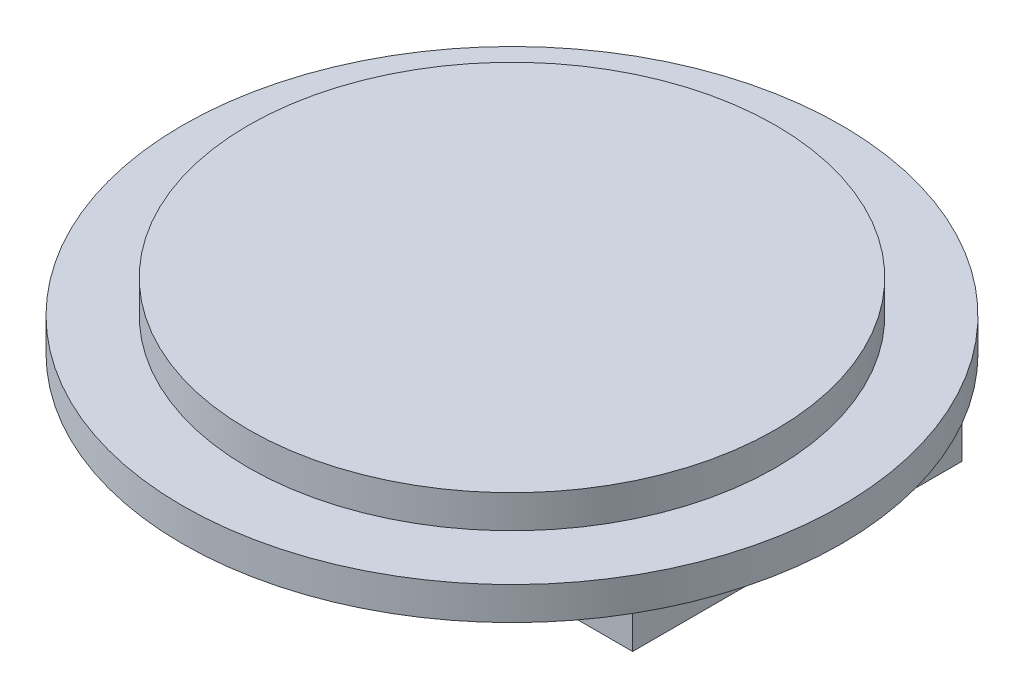
ISO-10303-21;
HEADER;
FILE_DESCRIPTION(('STEP AP214'),'2;1');
FILE_NAME('part.step','',(''),(''),'','','');
FILE_SCHEMA(('AUTOMOTIVE_DESIGN { 1 0 10303 214 1 1 1 1 }'));
ENDSEC;
DATA;
#1=APPLICATION_CONTEXT('core data for automotive mechanical design processes');
#2=APPLICATION_PROTOCOL_DEFINITION('international standard','automotive_design',2000,#1);
#3=PRODUCT_CONTEXT('',#1,'mechanical');
#4=PRODUCT('Part','Part','',(#3));
#5=PRODUCT_RELATED_PRODUCT_CATEGORY('part','',(#4));
#6=PRODUCT_DEFINITION_FORMATION('','',#4);
#7=PRODUCT_DEFINITION_CONTEXT('part definition',#1,'design');
#8=PRODUCT_DEFINITION('design','',#6,#7);
#9=PRODUCT_DEFINITION_SHAPE('','',#8);
#10=(LENGTH_UNIT() NAMED_UNIT(*) SI_UNIT(.MILLI.,.METRE.));
#11=(NAMED_UNIT(*) PLANE_ANGLE_UNIT() SI_UNIT($,.RADIAN.));
#12=(NAMED_UNIT(*) SI_UNIT($,.STERADIAN.) SOLID_ANGLE_UNIT());
#13=UNCERTAINTY_MEASURE_WITH_UNIT(LENGTH_MEASURE(1.E-05),#10,'distance_accuracy_value','');
#14=(GEOMETRIC_REPRESENTATION_CONTEXT(3) GLOBAL_UNCERTAINTY_ASSIGNED_CONTEXT((#13)) GLOBAL_UNIT_ASSIGNED_CONTEXT((#10,
#11,#12)) REPRESENTATION_CONTEXT('',''));
#15=CARTESIAN_POINT('',(0.,0.,0.));
#16=DIRECTION('',(0.,0.,1.));
#17=DIRECTION('',(1.,0.,0.));
#18=AXIS2_PLACEMENT_3D('',#15,#16,#17);
#19=CARTESIAN_POINT('',(0.,0.,0.));
#20=DIRECTION('',(0.,1.,0.));
#21=DIRECTION('',(0.,0.,1.));
#22=AXIS2_PLACEMENT_3D('',#19,#20,#21);
#23=PLANE('',#22);
#24=DIRECTION('',(0.,0.,1.));
#25=VECTOR('',#24,1.);
#26=CARTESIAN_POINT('',(8.66025403784439,0.,-5.));
#27=LINE('',#26,#25);
#28=CARTESIAN_POINT('',(8.66025403784439,0.,-5.));
#29=VERTEX_POINT('',#28);
#30=CARTESIAN_POINT('',(8.66025403784439,0.,5.));
#31=VERTEX_POINT('',#30);
#32=EDGE_CURVE('E67',#29,#31,#27,.T.);
#33=ORIENTED_EDGE('',*,*,#32,.F.);
#34=CARTESIAN_POINT('',(0.,0.,0.));
#35=DIRECTION('',(0.,1.,0.));
#36=DIRECTION('',(0.,0.,1.));
#37=AXIS2_PLACEMENT_3D('',#34,#35,#36);
#38=CIRCLE('',#37,10.);
#39=EDGE_CURVE('E47',#31,#29,#38,.T.);
#40=ORIENTED_EDGE('',*,*,#39,.F.);
#41=EDGE_LOOP('',(#33,#40));
#42=FACE_BOUND('',#41,.T.);
#43=ADVANCED_FACE('F43',(#42),#23,.F.);
#44=DIRECTION('',(1.,0.,0.));
#45=VECTOR('',#44,1.);
#46=CARTESIAN_POINT('',(-8.66025403784438,0.,-5.));
#47=LINE('',#46,#45);
#48=CARTESIAN_POINT('',(-8.66025403784438,0.,-5.00000000000001));
#49=VERTEX_POINT('',#48);
#50=EDGE_CURVE('E60',#49,#29,#47,.T.);
#51=ORIENTED_EDGE('',*,*,#50,.F.);
#52=EDGE_CURVE('E129',#29,#49,#38,.T.);
#53=ORIENTED_EDGE('',*,*,#52,.F.);
#54=EDGE_LOOP('',(#51,#53));
#55=FACE_BOUND('',#54,.T.);
#56=ADVANCED_FACE('F177',(#55),#23,.F.);
#57=DIRECTION('',(0.,0.,-1.));
#58=VECTOR('',#57,1.);
#59=CARTESIAN_POINT('',(-8.66025403784438,0.,-5.));
#60=LINE('',#59,#58);
#61=CARTESIAN_POINT('',(-8.66025403784438,0.,5.));
#62=VERTEX_POINT('',#61);
#63=EDGE_CURVE('E144',#62,#49,#60,.T.);
#64=ORIENTED_EDGE('',*,*,#63,.F.);
#65=EDGE_CURVE('E134',#49,#62,#38,.T.);
#66=ORIENTED_EDGE('',*,*,#65,.F.);
#67=EDGE_LOOP('',(#64,#66));
#68=FACE_BOUND('',#67,.T.);
#69=ADVANCED_FACE('F145',(#68),#23,.F.);
#70=DIRECTION('',(-1.,0.,0.));
#71=VECTOR('',#70,1.);
#72=CARTESIAN_POINT('',(-8.66025403784438,0.,5.));
#73=LINE('',#72,#71);
#74=EDGE_CURVE('E143',#31,#62,#73,.T.);
#75=ORIENTED_EDGE('',*,*,#74,.F.);
#76=EDGE_CURVE('E118',#62,#31,#38,.T.);
#77=ORIENTED_EDGE('',*,*,#76,.F.);
#78=EDGE_LOOP('',(#75,#77));
#79=FACE_BOUND('',#78,.T.);
#80=ADVANCED_FACE('F142',(#79),#23,.F.);
#81=CARTESIAN_POINT('',(0.,1.,0.));
#82=DIRECTION('',(0.,-1.,0.));
#83=DIRECTION('',(0.,0.,-1.));
#84=AXIS2_PLACEMENT_3D('',#81,#82,#83);
#85=CYLINDRICAL_SURFACE('',#84,10.);
#86=CARTESIAN_POINT('',(0.,1.,0.));
#87=DIRECTION('',(0.,1.,0.));
#88=DIRECTION('',(0.,0.,1.));
#89=AXIS2_PLACEMENT_3D('',#86,#87,#88);
#90=CIRCLE('',#89,10.);
#91=CARTESIAN_POINT('',(0.,1.,10.));
#92=VERTEX_POINT('',#91);
#93=EDGE_CURVE('E53',#92,#92,#90,.T.);
#94=ORIENTED_EDGE('',*,*,#93,.F.);
#95=EDGE_LOOP('',(#94));
#96=FACE_BOUND('',#95,.T.);
#97=ORIENTED_EDGE('',*,*,#39,.T.);
#98=ORIENTED_EDGE('',*,*,#52,.T.);
#99=ORIENTED_EDGE('',*,*,#65,.T.);
#100=ORIENTED_EDGE('',*,*,#76,.T.);
#101=EDGE_LOOP('',(#97,#98,#99,#100));
#102=FACE_BOUND('',#101,.T.);
#103=ADVANCED_FACE('F45',(#96,#102),#85,.T.);
#104=CARTESIAN_POINT('',(0.,1.,0.));
#105=DIRECTION('',(0.,1.,0.));
#106=DIRECTION('',(0.,0.,1.));
#107=AXIS2_PLACEMENT_3D('',#104,#105,#106);
#108=PLANE('',#107);
#109=CARTESIAN_POINT('',(0.,1.,0.));
#110=DIRECTION('',(0.,1.,0.));
#111=DIRECTION('',(0.,0.,1.));
#112=AXIS2_PLACEMENT_3D('',#109,#110,#111);
#113=CIRCLE('',#112,8.);
#114=CARTESIAN_POINT('',(0.,1.,8.));
#115=VERTEX_POINT('',#114);
#116=EDGE_CURVE('E11',#115,#115,#113,.T.);
#117=ORIENTED_EDGE('',*,*,#116,.F.);
#118=EDGE_LOOP('',(#117));
#119=FACE_BOUND('',#118,.T.);
#120=ORIENTED_EDGE('',*,*,#93,.T.);
#121=EDGE_LOOP('',(#120));
#122=FACE_BOUND('',#121,.T.);
#123=ADVANCED_FACE('F188',(#119,#122),#108,.T.);
#124=CARTESIAN_POINT('',(0.,2.,0.));
#125=DIRECTION('',(0.,-1.,0.));
#126=DIRECTION('',(0.,0.,-1.));
#127=AXIS2_PLACEMENT_3D('',#124,#125,#126);
#128=CYLINDRICAL_SURFACE('',#127,8.);
#129=CARTESIAN_POINT('',(0.,2.,0.));
#130=DIRECTION('',(0.,1.,0.));
#131=DIRECTION('',(0.,0.,1.));
#132=AXIS2_PLACEMENT_3D('',#129,#130,#131);
#133=CIRCLE('',#132,8.);
#134=CARTESIAN_POINT('',(0.,2.,8.));
#135=VERTEX_POINT('',#134);
#136=EDGE_CURVE('E113',#135,#135,#133,.T.);
#137=ORIENTED_EDGE('',*,*,#136,.F.);
#138=EDGE_LOOP('',(#137));
#139=FACE_BOUND('',#138,.T.);
#140=ORIENTED_EDGE('',*,*,#116,.T.);
#141=EDGE_LOOP('',(#140));
#142=FACE_BOUND('',#141,.T.);
#143=ADVANCED_FACE('F261',(#139,#142),#128,.T.);
#144=CARTESIAN_POINT('',(0.,2.,0.));
#145=DIRECTION('',(0.,1.,0.));
#146=DIRECTION('',(0.,0.,1.));
#147=AXIS2_PLACEMENT_3D('',#144,#145,#146);
#148=PLANE('',#147);
#149=ORIENTED_EDGE('',*,*,#136,.T.);
#150=EDGE_LOOP('',(#149));
#151=FACE_BOUND('',#150,.T.);
#152=ADVANCED_FACE('F211',(#151),#148,.T.);
#153=CARTESIAN_POINT('',(8.66025403784439,-1.,-5.));
#154=DIRECTION('',(-1.,0.,0.));
#155=DIRECTION('',(0.,0.,1.));
#156=AXIS2_PLACEMENT_3D('',#153,#154,#155);
#157=PLANE('',#156);
#158=ORIENTED_EDGE('',*,*,#32,.T.);
#159=DIRECTION('',(0.,1.,0.));
#160=VECTOR('',#159,1.);
#161=CARTESIAN_POINT('',(8.66025403784439,-1.,5.));
#162=LINE('',#161,#160);
#163=CARTESIAN_POINT('',(8.66025403784439,-1.,5.));
#164=VERTEX_POINT('',#163);
#165=EDGE_CURVE('E93',#164,#31,#162,.T.);
#166=ORIENTED_EDGE('',*,*,#165,.F.);
#167=DIRECTION('',(0.,0.,1.));
#168=VECTOR('',#167,1.);
#169=CARTESIAN_POINT('',(8.66025403784439,-1.,-5.));
#170=LINE('',#169,#168);
#171=CARTESIAN_POINT('',(8.66025403784439,-1.,-5.));
#172=VERTEX_POINT('',#171);
#173=EDGE_CURVE('E100',#172,#164,#170,.T.);
#174=ORIENTED_EDGE('',*,*,#173,.F.);
#175=DIRECTION('',(0.,1.,0.));
#176=VECTOR('',#175,1.);
#177=CARTESIAN_POINT('',(8.66025403784439,-1.,-5.));
#178=LINE('',#177,#176);
#179=EDGE_CURVE('E157',#172,#29,#178,.T.);
#180=ORIENTED_EDGE('',*,*,#179,.T.);
#181=EDGE_LOOP('',(#158,#166,#174,#180));
#182=FACE_BOUND('',#181,.T.);
#183=ADVANCED_FACE('F111',(#182),#157,.F.);
#184=CARTESIAN_POINT('',(-8.66025403784438,-1.,5.));
#185=DIRECTION('',(0.,0.,-1.));
#186=DIRECTION('',(-1.,0.,0.));
#187=AXIS2_PLACEMENT_3D('',#184,#185,#186);
#188=PLANE('',#187);
#189=ORIENTED_EDGE('',*,*,#74,.T.);
#190=DIRECTION('',(0.,1.,0.));
#191=VECTOR('',#190,1.);
#192=CARTESIAN_POINT('',(-8.66025403784438,-1.,5.));
#193=LINE('',#192,#191);
#194=CARTESIAN_POINT('',(-8.66025403784438,-1.,5.));
#195=VERTEX_POINT('',#194);
#196=EDGE_CURVE('E95',#195,#62,#193,.T.);
#197=ORIENTED_EDGE('',*,*,#196,.F.);
#198=DIRECTION('',(-1.,0.,0.));
#199=VECTOR('',#198,1.);
#200=CARTESIAN_POINT('',(-8.66025403784438,-1.,5.));
#201=LINE('',#200,#199);
#202=EDGE_CURVE('E88',#164,#195,#201,.T.);
#203=ORIENTED_EDGE('',*,*,#202,.F.);
#204=ORIENTED_EDGE('',*,*,#165,.T.);
#205=EDGE_LOOP('',(#189,#197,#203,#204));
#206=FACE_BOUND('',#205,.T.);
#207=ADVANCED_FACE('F91',(#206),#188,.F.);
#208=CARTESIAN_POINT('',(-8.66025403784438,-1.,-5.));
#209=DIRECTION('',(1.,0.,0.));
#210=DIRECTION('',(0.,0.,-1.));
#211=AXIS2_PLACEMENT_3D('',#208,#209,#210);
#212=PLANE('',#211);
#213=ORIENTED_EDGE('',*,*,#63,.T.);
#214=DIRECTION('',(0.,1.,0.));
#215=VECTOR('',#214,1.);
#216=CARTESIAN_POINT('',(-8.66025403784438,-1.,-5.));
#217=LINE('',#216,#215);
#218=CARTESIAN_POINT('',(-8.66025403784438,-1.,-5.));
#219=VERTEX_POINT('',#218);
#220=EDGE_CURVE('E120',#219,#49,#217,.T.);
#221=ORIENTED_EDGE('',*,*,#220,.F.);
#222=DIRECTION('',(0.,0.,-1.));
#223=VECTOR('',#222,1.);
#224=CARTESIAN_POINT('',(-8.66025403784438,-1.,-5.));
#225=LINE('',#224,#223);
#226=EDGE_CURVE('E99',#195,#219,#225,.T.);
#227=ORIENTED_EDGE('',*,*,#226,.F.);
#228=ORIENTED_EDGE('',*,*,#196,.T.);
#229=EDGE_LOOP('',(#213,#221,#227,#228));
#230=FACE_BOUND('',#229,.T.);
#231=ADVANCED_FACE('F153',(#230),#212,.F.);
#232=CARTESIAN_POINT('',(-8.66025403784438,-1.,-5.));
#233=DIRECTION('',(0.,0.,1.));
#234=DIRECTION('',(1.,0.,0.));
#235=AXIS2_PLACEMENT_3D('',#232,#233,#234);
#236=PLANE('',#235);
#237=ORIENTED_EDGE('',*,*,#50,.T.);
#238=ORIENTED_EDGE('',*,*,#179,.F.);
#239=DIRECTION('',(1.,0.,0.));
#240=VECTOR('',#239,1.);
#241=CARTESIAN_POINT('',(-8.66025403784438,-1.,-5.));
#242=LINE('',#241,#240);
#243=EDGE_CURVE('E105',#219,#172,#242,.T.);
#244=ORIENTED_EDGE('',*,*,#243,.F.);
#245=ORIENTED_EDGE('',*,*,#220,.T.);
#246=EDGE_LOOP('',(#237,#238,#244,#245));
#247=FACE_BOUND('',#246,.T.);
#248=ADVANCED_FACE('F167',(#247),#236,.F.);
#249=CARTESIAN_POINT('',(0.,-1.,0.));
#250=DIRECTION('',(0.,1.,0.));
#251=DIRECTION('',(0.,0.,1.));
#252=AXIS2_PLACEMENT_3D('',#249,#250,#251);
#253=PLANE('',#252);
#254=ORIENTED_EDGE('',*,*,#173,.T.);
#255=ORIENTED_EDGE('',*,*,#202,.T.);
#256=ORIENTED_EDGE('',*,*,#226,.T.);
#257=ORIENTED_EDGE('',*,*,#243,.T.);
#258=EDGE_LOOP('',(#254,#255,#256,#257));
#259=FACE_BOUND('',#258,.T.);
#260=ADVANCED_FACE('F103',(#259),#253,.F.);
#261=CLOSED_SHELL('',(#43,#56,#69,#80,#103,#123,#143,#152,#183,#207,#231,#248,#260));
#262=MANIFOLD_SOLID_BREP('B2',#261);
#263=ADVANCED_BREP_SHAPE_REPRESENTATION('',(#18,#262),#14);
#264=SHAPE_DEFINITION_REPRESENTATION(#9,#263);
ENDSEC;
END-ISO-10303-21;
